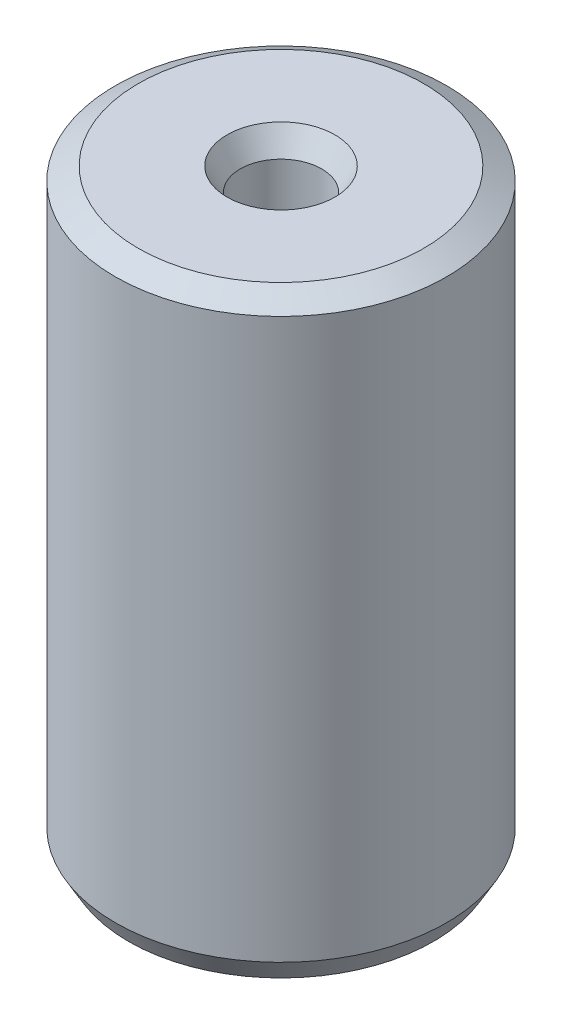
ISO-10303-21;
HEADER;
FILE_DESCRIPTION(('STEP AP214'),'2;1');
FILE_NAME('part.step','',(''),(''),'','','');
FILE_SCHEMA(('AUTOMOTIVE_DESIGN { 1 0 10303 214 1 1 1 1 }'));
ENDSEC;
DATA;
#1=APPLICATION_CONTEXT('core data for automotive mechanical design processes');
#2=APPLICATION_PROTOCOL_DEFINITION('international standard','automotive_design',2000,#1);
#3=PRODUCT_CONTEXT('',#1,'mechanical');
#4=PRODUCT('Part','Part','',(#3));
#5=PRODUCT_RELATED_PRODUCT_CATEGORY('part','',(#4));
#6=PRODUCT_DEFINITION_FORMATION('','',#4);
#7=PRODUCT_DEFINITION_CONTEXT('part definition',#1,'design');
#8=PRODUCT_DEFINITION('design','',#6,#7);
#9=PRODUCT_DEFINITION_SHAPE('','',#8);
#10=(LENGTH_UNIT() NAMED_UNIT(*) SI_UNIT(.MILLI.,.METRE.));
#11=(NAMED_UNIT(*) PLANE_ANGLE_UNIT() SI_UNIT($,.RADIAN.));
#12=(NAMED_UNIT(*) SI_UNIT($,.STERADIAN.) SOLID_ANGLE_UNIT());
#13=UNCERTAINTY_MEASURE_WITH_UNIT(LENGTH_MEASURE(1.E-05),#10,'distance_accuracy_value','');
#14=(GEOMETRIC_REPRESENTATION_CONTEXT(3) GLOBAL_UNCERTAINTY_ASSIGNED_CONTEXT((#13)) GLOBAL_UNIT_ASSIGNED_CONTEXT((#10,
#11,#12)) REPRESENTATION_CONTEXT('',''));
#15=CARTESIAN_POINT('',(0.,0.,0.));
#16=DIRECTION('',(0.,0.,1.));
#17=DIRECTION('',(1.,0.,0.));
#18=AXIS2_PLACEMENT_3D('',#15,#16,#17);
#19=CARTESIAN_POINT('',(0.,17.9749287621869,0.));
#20=DIRECTION('',(0.,-1.,0.));
#21=DIRECTION('',(0.,0.,-1.));
#22=AXIS2_PLACEMENT_3D('',#19,#20,#21);
#23=CYLINDRICAL_SURFACE('',#22,5.);
#24=CARTESIAN_POINT('',(0.,0.690973016529539,0.));
#25=DIRECTION('',(0.,1.,0.));
#26=DIRECTION('',(0.,0.,1.));
#27=AXIS2_PLACEMENT_3D('',#24,#25,#26);
#28=CIRCLE('',#27,5.);
#29=CARTESIAN_POINT('',(0.,0.690973016529539,5.));
#30=VERTEX_POINT('',#29);
#31=EDGE_CURVE('E10',#30,#30,#28,.T.);
#32=ORIENTED_EDGE('',*,*,#31,.T.);
#33=EDGE_LOOP('',(#32));
#34=FACE_BOUND('',#33,.T.);
#35=CARTESIAN_POINT('',(0.,17.5759953050908,0.));
#36=DIRECTION('',(0.,1.,0.));
#37=DIRECTION('',(0.,0.,1.));
#38=AXIS2_PLACEMENT_3D('',#35,#36,#37);
#39=CIRCLE('',#38,5.);
#40=CARTESIAN_POINT('',(0.,17.5759953050908,5.));
#41=VERTEX_POINT('',#40);
#42=EDGE_CURVE('E50',#41,#41,#39,.F.);
#43=ORIENTED_EDGE('',*,*,#42,.T.);
#44=EDGE_LOOP('',(#43));
#45=FACE_BOUND('',#44,.T.);
#46=ADVANCED_FACE('F39',(#34,#45),#23,.T.);
#47=CARTESIAN_POINT('',(0.,17.9749287621869,0.));
#48=DIRECTION('',(0.,1.,0.));
#49=DIRECTION('',(0.,0.,1.));
#50=AXIS2_PLACEMENT_3D('',#47,#48,#49);
#51=PLANE('',#50);
#52=CARTESIAN_POINT('',(0.,17.9749287621869,0.));
#53=DIRECTION('',(0.,1.,0.));
#54=DIRECTION('',(0.,0.,1.));
#55=AXIS2_PLACEMENT_3D('',#52,#53,#54);
#56=CIRCLE('',#55,1.62892007224053);
#57=CARTESIAN_POINT('',(0.,17.9749287621869,1.62892007224053));
#58=VERTEX_POINT('',#57);
#59=EDGE_CURVE('E58',#58,#58,#56,.F.);
#60=ORIENTED_EDGE('',*,*,#59,.T.);
#61=EDGE_LOOP('',(#60));
#62=FACE_BOUND('',#61,.T.);
#63=CARTESIAN_POINT('',(0.,17.9749287621869,0.));
#64=DIRECTION('',(0.,1.,0.));
#65=DIRECTION('',(0.,0.,1.));
#66=AXIS2_PLACEMENT_3D('',#63,#64,#65);
#67=CIRCLE('',#66,4.30902698347047);
#68=CARTESIAN_POINT('',(0.,17.9749287621869,4.30902698347047));
#69=VERTEX_POINT('',#68);
#70=EDGE_CURVE('E61',#69,#69,#67,.T.);
#71=ORIENTED_EDGE('',*,*,#70,.T.);
#72=EDGE_LOOP('',(#71));
#73=FACE_BOUND('',#72,.T.);
#74=ADVANCED_FACE('F88',(#62,#73),#51,.T.);
#75=CARTESIAN_POINT('',(0.,0.,0.));
#76=DIRECTION('',(0.,1.,0.));
#77=DIRECTION('',(0.,0.,1.));
#78=AXIS2_PLACEMENT_3D('',#75,#76,#77);
#79=PLANE('',#78);
#80=CARTESIAN_POINT('',(0.,0.,0.));
#81=DIRECTION('',(0.,1.,0.));
#82=DIRECTION('',(0.,0.,1.));
#83=AXIS2_PLACEMENT_3D('',#80,#81,#82);
#84=CIRCLE('',#83,1.92095963167397);
#85=CARTESIAN_POINT('',(0.,0.,1.92095963167397));
#86=VERTEX_POINT('',#85);
#87=EDGE_CURVE('E51',#86,#86,#84,.T.);
#88=ORIENTED_EDGE('',*,*,#87,.T.);
#89=EDGE_LOOP('',(#88));
#90=FACE_BOUND('',#89,.T.);
#91=CARTESIAN_POINT('',(0.,0.,0.));
#92=DIRECTION('',(0.,1.,0.));
#93=DIRECTION('',(0.,0.,1.));
#94=AXIS2_PLACEMENT_3D('',#91,#92,#93);
#95=CIRCLE('',#94,4.6010665429039);
#96=CARTESIAN_POINT('',(0.,0.,4.6010665429039));
#97=VERTEX_POINT('',#96);
#98=EDGE_CURVE('E54',#97,#97,#95,.F.);
#99=ORIENTED_EDGE('',*,*,#98,.T.);
#100=EDGE_LOOP('',(#99));
#101=FACE_BOUND('',#100,.T.);
#102=ADVANCED_FACE('F83',(#90,#101),#79,.F.);
#103=CARTESIAN_POINT('',(0.,17.9749287621869,0.));
#104=DIRECTION('',(0.,-1.,0.));
#105=DIRECTION('',(0.,0.,-1.));
#106=AXIS2_PLACEMENT_3D('',#103,#104,#105);
#107=CYLINDRICAL_SURFACE('',#106,1.22998661514444);
#108=CARTESIAN_POINT('',(0.,17.2839557456574,0.));
#109=DIRECTION('',(0.,1.,0.));
#110=DIRECTION('',(0.,0.,1.));
#111=AXIS2_PLACEMENT_3D('',#108,#109,#110);
#112=CIRCLE('',#111,1.22998661514444);
#113=CARTESIAN_POINT('',(0.,17.2839557456574,1.22998661514444));
#114=VERTEX_POINT('',#113);
#115=EDGE_CURVE('E67',#114,#114,#112,.T.);
#116=ORIENTED_EDGE('',*,*,#115,.T.);
#117=EDGE_LOOP('',(#116));
#118=FACE_BOUND('',#117,.T.);
#119=CARTESIAN_POINT('',(0.,0.398933457096094,0.));
#120=DIRECTION('',(0.,1.,0.));
#121=DIRECTION('',(0.,0.,1.));
#122=AXIS2_PLACEMENT_3D('',#119,#120,#121);
#123=CIRCLE('',#122,1.22998661514444);
#124=CARTESIAN_POINT('',(0.,0.398933457096094,1.22998661514444));
#125=VERTEX_POINT('',#124);
#126=EDGE_CURVE('E69',#125,#125,#123,.F.);
#127=ORIENTED_EDGE('',*,*,#126,.T.);
#128=EDGE_LOOP('',(#127));
#129=FACE_BOUND('',#128,.T.);
#130=ADVANCED_FACE('F71',(#118,#129),#107,.F.);
#131=CARTESIAN_POINT('',(0.,17.2839557456574,0.));
#132=DIRECTION('',(0.,1.,0.));
#133=DIRECTION('',(0.,0.,1.));
#134=AXIS2_PLACEMENT_3D('',#131,#132,#133);
#135=CONICAL_SURFACE('',#134,1.22998661514444,0.523598775598301);
#136=ORIENTED_EDGE('',*,*,#59,.F.);
#137=EDGE_LOOP('',(#136));
#138=FACE_BOUND('',#137,.T.);
#139=ORIENTED_EDGE('',*,*,#115,.F.);
#140=EDGE_LOOP('',(#139));
#141=FACE_BOUND('',#140,.T.);
#142=ADVANCED_FACE('F77',(#138,#141),#135,.F.);
#143=CARTESIAN_POINT('',(0.,0.,0.));
#144=DIRECTION('',(0.,-1.,0.));
#145=DIRECTION('',(0.,0.,-1.));
#146=AXIS2_PLACEMENT_3D('',#143,#144,#145);
#147=CONICAL_SURFACE('',#146,1.92095963167397,1.0471975511966);
#148=ORIENTED_EDGE('',*,*,#126,.F.);
#149=EDGE_LOOP('',(#148));
#150=FACE_BOUND('',#149,.T.);
#151=ORIENTED_EDGE('',*,*,#87,.F.);
#152=EDGE_LOOP('',(#151));
#153=FACE_BOUND('',#152,.T.);
#154=ADVANCED_FACE('F73',(#150,#153),#147,.F.);
#155=CARTESIAN_POINT('',(0.,0.690973016529539,0.));
#156=DIRECTION('',(0.,1.,0.));
#157=DIRECTION('',(0.,0.,1.));
#158=AXIS2_PLACEMENT_3D('',#155,#156,#157);
#159=CONICAL_SURFACE('',#158,5.,0.523598775598303);
#160=ORIENTED_EDGE('',*,*,#98,.F.);
#161=EDGE_LOOP('',(#160));
#162=FACE_BOUND('',#161,.T.);
#163=ORIENTED_EDGE('',*,*,#31,.F.);
#164=EDGE_LOOP('',(#163));
#165=FACE_BOUND('',#164,.T.);
#166=ADVANCED_FACE('F76',(#162,#165),#159,.T.);
#167=CARTESIAN_POINT('',(0.,17.9749287621869,0.));
#168=DIRECTION('',(0.,-1.,0.));
#169=DIRECTION('',(0.,0.,-1.));
#170=AXIS2_PLACEMENT_3D('',#167,#168,#169);
#171=CONICAL_SURFACE('',#170,4.30902698347047,1.04719755119659);
#172=ORIENTED_EDGE('',*,*,#42,.F.);
#173=EDGE_LOOP('',(#172));
#174=FACE_BOUND('',#173,.T.);
#175=ORIENTED_EDGE('',*,*,#70,.F.);
#176=EDGE_LOOP('',(#175));
#177=FACE_BOUND('',#176,.T.);
#178=ADVANCED_FACE('F45',(#174,#177),#171,.T.);
#179=CLOSED_SHELL('',(#46,#74,#102,#130,#142,#154,#166,#178));
#180=MANIFOLD_SOLID_BREP('B2',#179);
#181=ADVANCED_BREP_SHAPE_REPRESENTATION('',(#18,#180),#14);
#182=SHAPE_DEFINITION_REPRESENTATION(#9,#181);
ENDSEC;
END-ISO-10303-21;
